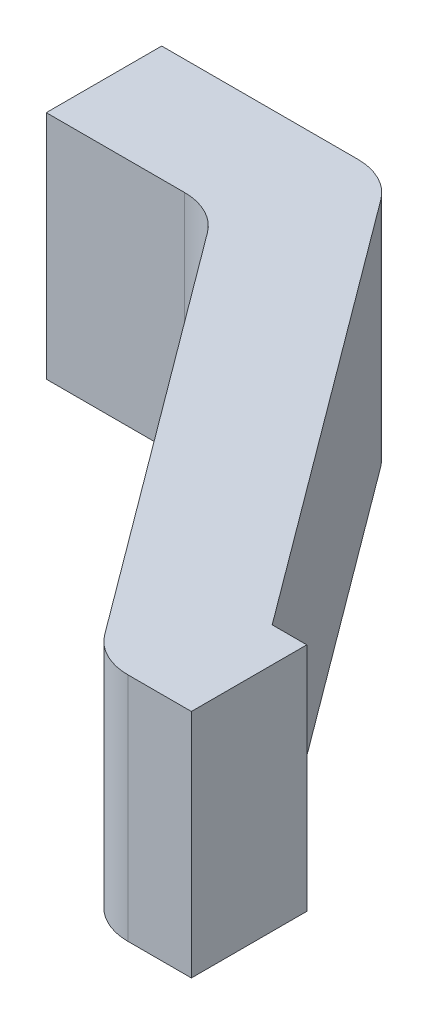
ISO-10303-21;
HEADER;
FILE_DESCRIPTION(('STEP AP214'),'2;1');
FILE_NAME('part.step','',(''),(''),'','','');
FILE_SCHEMA(('AUTOMOTIVE_DESIGN { 1 0 10303 214 1 1 1 1 }'));
ENDSEC;
DATA;
#1=APPLICATION_CONTEXT('core data for automotive mechanical design processes');
#2=APPLICATION_PROTOCOL_DEFINITION('international standard','automotive_design',2000,#1);
#3=PRODUCT_CONTEXT('',#1,'mechanical');
#4=PRODUCT('Part','Part','',(#3));
#5=PRODUCT_RELATED_PRODUCT_CATEGORY('part','',(#4));
#6=PRODUCT_DEFINITION_FORMATION('','',#4);
#7=PRODUCT_DEFINITION_CONTEXT('part definition',#1,'design');
#8=PRODUCT_DEFINITION('design','',#6,#7);
#9=PRODUCT_DEFINITION_SHAPE('','',#8);
#10=(LENGTH_UNIT() NAMED_UNIT(*) SI_UNIT(.MILLI.,.METRE.));
#11=(NAMED_UNIT(*) PLANE_ANGLE_UNIT() SI_UNIT($,.RADIAN.));
#12=(NAMED_UNIT(*) SI_UNIT($,.STERADIAN.) SOLID_ANGLE_UNIT());
#13=UNCERTAINTY_MEASURE_WITH_UNIT(LENGTH_MEASURE(1.E-05),#10,'distance_accuracy_value','');
#14=(GEOMETRIC_REPRESENTATION_CONTEXT(3) GLOBAL_UNCERTAINTY_ASSIGNED_CONTEXT((#13)) GLOBAL_UNIT_ASSIGNED_CONTEXT((#10,
#11,#12)) REPRESENTATION_CONTEXT('',''));
#15=CARTESIAN_POINT('',(0.,0.,0.));
#16=DIRECTION('',(0.,0.,1.));
#17=DIRECTION('',(1.,0.,0.));
#18=AXIS2_PLACEMENT_3D('',#15,#16,#17);
#19=CARTESIAN_POINT('',(-3.,-0.84,0.205));
#20=DIRECTION('',(0.,0.,1.));
#21=DIRECTION('',(1.,0.,0.));
#22=AXIS2_PLACEMENT_3D('',#19,#20,#21);
#23=PLANE('',#22);
#24=DIRECTION('',(1.,0.,0.));
#25=VECTOR('',#24,1.);
#26=CARTESIAN_POINT('',(-3.,-0.43,0.205));
#27=LINE('',#26,#25);
#28=CARTESIAN_POINT('',(-3.,-0.43,0.205));
#29=VERTEX_POINT('',#28);
#30=CARTESIAN_POINT('',(-2.754632601552,-0.43,0.205));
#31=VERTEX_POINT('',#30);
#32=EDGE_CURVE('E11',#29,#31,#27,.T.);
#33=ORIENTED_EDGE('',*,*,#32,.F.);
#34=DIRECTION('',(0.,1.,0.));
#35=VECTOR('',#34,1.);
#36=CARTESIAN_POINT('',(-3.,-0.84,0.205));
#37=LINE('',#36,#35);
#38=CARTESIAN_POINT('',(-3.,-0.84,0.205));
#39=VERTEX_POINT('',#38);
#40=EDGE_CURVE('E24',#39,#29,#37,.T.);
#41=ORIENTED_EDGE('',*,*,#40,.F.);
#42=DIRECTION('',(1.,0.,0.));
#43=VECTOR('',#42,1.);
#44=CARTESIAN_POINT('',(-3.,-0.84,0.205));
#45=LINE('',#44,#43);
#46=CARTESIAN_POINT('',(-2.754632601552,-0.84,0.205));
#47=VERTEX_POINT('',#46);
#48=EDGE_CURVE('E186',#39,#47,#45,.T.);
#49=ORIENTED_EDGE('',*,*,#48,.T.);
#50=DIRECTION('',(0.,1.,0.));
#51=VECTOR('',#50,1.);
#52=CARTESIAN_POINT('',(-2.754632601552,-0.84,0.205));
#53=LINE('',#52,#51);
#54=EDGE_CURVE('E184',#47,#31,#53,.T.);
#55=ORIENTED_EDGE('',*,*,#54,.T.);
#56=EDGE_LOOP('',(#33,#41,#49,#55));
#57=FACE_BOUND('',#56,.T.);
#58=ADVANCED_FACE('F17',(#57),#23,.T.);
#59=CARTESIAN_POINT('',(-3.,-0.43,0.));
#60=DIRECTION('',(0.,1.,0.));
#61=DIRECTION('',(0.,0.,1.));
#62=AXIS2_PLACEMENT_3D('',#59,#60,#61);
#63=PLANE('',#62);
#64=DIRECTION('',(1.,0.,0.));
#65=VECTOR('',#64,1.);
#66=CARTESIAN_POINT('',(-3.,-0.43,0.));
#67=LINE('',#66,#65);
#68=CARTESIAN_POINT('',(-3.,-0.43,0.));
#69=VERTEX_POINT('',#68);
#70=CARTESIAN_POINT('',(-2.651544200517,-0.43,0.));
#71=VERTEX_POINT('',#70);
#72=EDGE_CURVE('E182',#69,#71,#67,.T.);
#73=ORIENTED_EDGE('',*,*,#72,.F.);
#74=DIRECTION('',(0.,0.,1.));
#75=VECTOR('',#74,1.);
#76=CARTESIAN_POINT('',(-3.,-0.43,0.));
#77=LINE('',#76,#75);
#78=EDGE_CURVE('E180',#69,#29,#77,.T.);
#79=ORIENTED_EDGE('',*,*,#78,.T.);
#80=ORIENTED_EDGE('',*,*,#32,.T.);
#81=CARTESIAN_POINT('',(-2.754632601552,-0.43,0.3075));
#82=DIRECTION('',(0.,-1.,0.));
#83=DIRECTION('',(0.,0.,1.));
#84=AXIS2_PLACEMENT_3D('',#81,#82,#83);
#85=CIRCLE('',#84,0.1025);
#86=CARTESIAN_POINT('',(-2.672351357136,-0.43,0.246376789863));
#87=VERTEX_POINT('',#86);
#88=EDGE_CURVE('E178',#31,#87,#85,.T.);
#89=ORIENTED_EDGE('',*,*,#88,.T.);
#90=DIRECTION('',(0.596324001338072,0.,0.802743847954097));
#91=VECTOR('',#90,1.);
#92=CARTESIAN_POINT('',(-2.764562488831,-0.43,0.122246420274));
#93=LINE('',#92,#91);
#94=CARTESIAN_POINT('',(-2.145299532729,-0.43,0.955869630411));
#95=VERTEX_POINT('',#94);
#96=EDGE_CURVE('E176',#87,#95,#93,.T.);
#97=ORIENTED_EDGE('',*,*,#96,.T.);
#98=CARTESIAN_POINT('',(-2.063018288313,-0.43,0.894746420274));
#99=DIRECTION('',(0.,1.,0.));
#100=DIRECTION('',(0.,0.,1.));
#101=AXIS2_PLACEMENT_3D('',#98,#99,#100);
#102=CIRCLE('',#101,0.1025);
#103=CARTESIAN_POINT('',(-2.063018288313,-0.43,0.997246420274));
#104=VERTEX_POINT('',#103);
#105=EDGE_CURVE('E120',#95,#104,#102,.T.);
#106=ORIENTED_EDGE('',*,*,#105,.T.);
#107=DIRECTION('',(1.,0.,0.));
#108=VECTOR('',#107,1.);
#109=CARTESIAN_POINT('',(-2.114562488831,-0.43,0.997246420274));
#110=LINE('',#109,#108);
#111=CARTESIAN_POINT('',(-1.95,-0.43,0.997246420274));
#112=VERTEX_POINT('',#111);
#113=EDGE_CURVE('E173',#104,#112,#110,.T.);
#114=ORIENTED_EDGE('',*,*,#113,.T.);
#115=DIRECTION('',(0.,0.,1.));
#116=VECTOR('',#115,1.);
#117=CARTESIAN_POINT('',(-1.95,-0.43,0.792246420274));
#118=LINE('',#117,#116);
#119=CARTESIAN_POINT('',(-1.95,-0.43,0.792246420274));
#120=VERTEX_POINT('',#119);
#121=EDGE_CURVE('E170',#120,#112,#118,.T.);
#122=ORIENTED_EDGE('',*,*,#121,.F.);
#123=DIRECTION('',(1.,0.,0.));
#124=VECTOR('',#123,1.);
#125=CARTESIAN_POINT('',(-2.114562488831,-0.43,0.792246420274));
#126=LINE('',#125,#124);
#127=CARTESIAN_POINT('',(-2.011474087796,-0.43,0.792246420274));
#128=VERTEX_POINT('',#127);
#129=EDGE_CURVE('E167',#128,#120,#126,.T.);
#130=ORIENTED_EDGE('',*,*,#129,.F.);
#131=DIRECTION('',(0.596324001338072,0.,0.802743847954097));
#132=VECTOR('',#131,1.);
#133=CARTESIAN_POINT('',(-2.6,-0.43,0.));
#134=LINE('',#133,#132);
#135=CARTESIAN_POINT('',(-2.569262956102,-0.43,0.0413767898629));
#136=VERTEX_POINT('',#135);
#137=EDGE_CURVE('E164',#136,#128,#134,.T.);
#138=ORIENTED_EDGE('',*,*,#137,.F.);
#139=CARTESIAN_POINT('',(-2.651544200517,-0.43,0.1025));
#140=DIRECTION('',(0.,-1.,0.));
#141=DIRECTION('',(0.,0.,1.));
#142=AXIS2_PLACEMENT_3D('',#139,#140,#141);
#143=CIRCLE('',#142,0.1025);
#144=EDGE_CURVE('E161',#71,#136,#143,.T.);
#145=ORIENTED_EDGE('',*,*,#144,.F.);
#146=EDGE_LOOP('',(#73,#79,#80,#89,#97,#106,#114,#122,#130,#138,#145));
#147=FACE_BOUND('',#146,.T.);
#148=ADVANCED_FACE('F192',(#147),#63,.T.);
#149=CARTESIAN_POINT('',(-2.754632601552,-0.84,0.3075));
#150=DIRECTION('',(0.,1.,0.));
#151=DIRECTION('',(0.,0.,-1.));
#152=AXIS2_PLACEMENT_3D('',#149,#150,#151);
#153=CYLINDRICAL_SURFACE('',#152,0.1025);
#154=CARTESIAN_POINT('',(-2.754632601552,-0.84,0.3075));
#155=DIRECTION('',(0.,-1.,0.));
#156=DIRECTION('',(0.,0.,1.));
#157=AXIS2_PLACEMENT_3D('',#154,#155,#156);
#158=CIRCLE('',#157,0.1025);
#159=CARTESIAN_POINT('',(-2.672351357136,-0.84,0.246376789863));
#160=VERTEX_POINT('',#159);
#161=EDGE_CURVE('E159',#47,#160,#158,.T.);
#162=ORIENTED_EDGE('',*,*,#161,.T.);
#163=DIRECTION('',(0.,1.,0.));
#164=VECTOR('',#163,1.);
#165=CARTESIAN_POINT('',(-2.672351357136,-0.84,0.246376789863));
#166=LINE('',#165,#164);
#167=EDGE_CURVE('E102',#160,#87,#166,.T.);
#168=ORIENTED_EDGE('',*,*,#167,.T.);
#169=ORIENTED_EDGE('',*,*,#88,.F.);
#170=ORIENTED_EDGE('',*,*,#54,.F.);
#171=EDGE_LOOP('',(#162,#168,#169,#170));
#172=FACE_BOUND('',#171,.T.);
#173=ADVANCED_FACE('F216',(#172),#153,.F.);
#174=CARTESIAN_POINT('',(-3.,-0.84,0.));
#175=DIRECTION('',(1.,0.,0.));
#176=DIRECTION('',(0.,0.,1.));
#177=AXIS2_PLACEMENT_3D('',#174,#175,#176);
#178=PLANE('',#177);
#179=ORIENTED_EDGE('',*,*,#40,.T.);
#180=ORIENTED_EDGE('',*,*,#78,.F.);
#181=DIRECTION('',(0.,1.,0.));
#182=VECTOR('',#181,1.);
#183=CARTESIAN_POINT('',(-3.,-0.84,0.));
#184=LINE('',#183,#182);
#185=CARTESIAN_POINT('',(-3.,-0.84,0.));
#186=VERTEX_POINT('',#185);
#187=EDGE_CURVE('E155',#186,#69,#184,.T.);
#188=ORIENTED_EDGE('',*,*,#187,.F.);
#189=DIRECTION('',(0.,0.,1.));
#190=VECTOR('',#189,1.);
#191=CARTESIAN_POINT('',(-3.,-0.84,0.));
#192=LINE('',#191,#190);
#193=EDGE_CURVE('E152',#186,#39,#192,.T.);
#194=ORIENTED_EDGE('',*,*,#193,.T.);
#195=EDGE_LOOP('',(#179,#180,#188,#194));
#196=FACE_BOUND('',#195,.T.);
#197=ADVANCED_FACE('F189',(#196),#178,.F.);
#198=CARTESIAN_POINT('',(-3.,-0.84,0.));
#199=DIRECTION('',(0.,1.,0.));
#200=DIRECTION('',(0.,0.,1.));
#201=AXIS2_PLACEMENT_3D('',#198,#199,#200);
#202=PLANE('',#201);
#203=CARTESIAN_POINT('',(-2.651544200517,-0.84,0.1025));
#204=DIRECTION('',(0.,-1.,0.));
#205=DIRECTION('',(0.,0.,1.));
#206=AXIS2_PLACEMENT_3D('',#203,#204,#205);
#207=CIRCLE('',#206,0.1025);
#208=CARTESIAN_POINT('',(-2.651544200517,-0.84,0.));
#209=VERTEX_POINT('',#208);
#210=CARTESIAN_POINT('',(-2.569262956102,-0.84,0.0413767898629));
#211=VERTEX_POINT('',#210);
#212=EDGE_CURVE('E150',#209,#211,#207,.T.);
#213=ORIENTED_EDGE('',*,*,#212,.T.);
#214=DIRECTION('',(0.596324001338072,0.,0.802743847954097));
#215=VECTOR('',#214,1.);
#216=CARTESIAN_POINT('',(-2.6,-0.84,0.));
#217=LINE('',#216,#215);
#218=CARTESIAN_POINT('',(-2.011474087796,-0.84,0.792246420274));
#219=VERTEX_POINT('',#218);
#220=EDGE_CURVE('E147',#211,#219,#217,.T.);
#221=ORIENTED_EDGE('',*,*,#220,.T.);
#222=DIRECTION('',(1.,0.,0.));
#223=VECTOR('',#222,1.);
#224=CARTESIAN_POINT('',(-2.114562488831,-0.84,0.792246420274));
#225=LINE('',#224,#223);
#226=CARTESIAN_POINT('',(-1.95,-0.84,0.792246420274));
#227=VERTEX_POINT('',#226);
#228=EDGE_CURVE('E144',#219,#227,#225,.T.);
#229=ORIENTED_EDGE('',*,*,#228,.T.);
#230=DIRECTION('',(0.,0.,1.));
#231=VECTOR('',#230,1.);
#232=CARTESIAN_POINT('',(-1.95,-0.84,0.792246420274));
#233=LINE('',#232,#231);
#234=CARTESIAN_POINT('',(-1.95,-0.84,0.997246420274));
#235=VERTEX_POINT('',#234);
#236=EDGE_CURVE('E142',#227,#235,#233,.T.);
#237=ORIENTED_EDGE('',*,*,#236,.T.);
#238=DIRECTION('',(1.,0.,0.));
#239=VECTOR('',#238,1.);
#240=CARTESIAN_POINT('',(-2.114562488831,-0.84,0.997246420274));
#241=LINE('',#240,#239);
#242=CARTESIAN_POINT('',(-2.063018288313,-0.84,0.997246420274));
#243=VERTEX_POINT('',#242);
#244=EDGE_CURVE('E113',#243,#235,#241,.T.);
#245=ORIENTED_EDGE('',*,*,#244,.F.);
#246=CARTESIAN_POINT('',(-2.063018288313,-0.84,0.894746420274));
#247=DIRECTION('',(0.,1.,0.));
#248=DIRECTION('',(0.,0.,1.));
#249=AXIS2_PLACEMENT_3D('',#246,#247,#248);
#250=CIRCLE('',#249,0.1025);
#251=CARTESIAN_POINT('',(-2.145299532729,-0.84,0.955869630411));
#252=VERTEX_POINT('',#251);
#253=EDGE_CURVE('E106',#252,#243,#250,.T.);
#254=ORIENTED_EDGE('',*,*,#253,.F.);
#255=DIRECTION('',(0.596324001338072,0.,0.802743847954097));
#256=VECTOR('',#255,1.);
#257=CARTESIAN_POINT('',(-2.764562488831,-0.84,0.122246420274));
#258=LINE('',#257,#256);
#259=EDGE_CURVE('E95',#160,#252,#258,.T.);
#260=ORIENTED_EDGE('',*,*,#259,.F.);
#261=ORIENTED_EDGE('',*,*,#161,.F.);
#262=ORIENTED_EDGE('',*,*,#48,.F.);
#263=ORIENTED_EDGE('',*,*,#193,.F.);
#264=DIRECTION('',(1.,0.,0.));
#265=VECTOR('',#264,1.);
#266=CARTESIAN_POINT('',(-3.,-0.84,0.));
#267=LINE('',#266,#265);
#268=EDGE_CURVE('E107',#186,#209,#267,.T.);
#269=ORIENTED_EDGE('',*,*,#268,.T.);
#270=EDGE_LOOP('',(#213,#221,#229,#237,#245,#254,#260,#261,#262,#263,#269));
#271=FACE_BOUND('',#270,.T.);
#272=ADVANCED_FACE('F111',(#271),#202,.F.);
#273=CARTESIAN_POINT('',(-3.,-0.84,0.));
#274=DIRECTION('',(0.,0.,1.));
#275=DIRECTION('',(1.,0.,0.));
#276=AXIS2_PLACEMENT_3D('',#273,#274,#275);
#277=PLANE('',#276);
#278=DIRECTION('',(0.,1.,0.));
#279=VECTOR('',#278,1.);
#280=CARTESIAN_POINT('',(-2.651544200517,-0.84,0.));
#281=LINE('',#280,#279);
#282=EDGE_CURVE('E137',#209,#71,#281,.T.);
#283=ORIENTED_EDGE('',*,*,#282,.F.);
#284=ORIENTED_EDGE('',*,*,#268,.F.);
#285=ORIENTED_EDGE('',*,*,#187,.T.);
#286=ORIENTED_EDGE('',*,*,#72,.T.);
#287=EDGE_LOOP('',(#283,#284,#285,#286));
#288=FACE_BOUND('',#287,.T.);
#289=ADVANCED_FACE('F196',(#288),#277,.F.);
#290=CARTESIAN_POINT('',(-2.651544200517,-0.84,0.1025));
#291=DIRECTION('',(0.,1.,0.));
#292=DIRECTION('',(0.,0.,-1.));
#293=AXIS2_PLACEMENT_3D('',#290,#291,#292);
#294=CYLINDRICAL_SURFACE('',#293,0.1025);
#295=ORIENTED_EDGE('',*,*,#282,.T.);
#296=ORIENTED_EDGE('',*,*,#144,.T.);
#297=DIRECTION('',(0.,1.,0.));
#298=VECTOR('',#297,1.);
#299=CARTESIAN_POINT('',(-2.569262956102,-0.84,0.0413767898629));
#300=LINE('',#299,#298);
#301=EDGE_CURVE('E134',#211,#136,#300,.T.);
#302=ORIENTED_EDGE('',*,*,#301,.F.);
#303=ORIENTED_EDGE('',*,*,#212,.F.);
#304=EDGE_LOOP('',(#295,#296,#302,#303));
#305=FACE_BOUND('',#304,.T.);
#306=ADVANCED_FACE('F201',(#305),#294,.T.);
#307=CARTESIAN_POINT('',(-2.6,-0.84,0.));
#308=DIRECTION('',(0.802743847954097,0.,-0.596324001338072));
#309=DIRECTION('',(0.596324001338072,0.,0.802743847954097));
#310=AXIS2_PLACEMENT_3D('',#307,#308,#309);
#311=PLANE('',#310);
#312=ORIENTED_EDGE('',*,*,#220,.F.);
#313=ORIENTED_EDGE('',*,*,#301,.T.);
#314=ORIENTED_EDGE('',*,*,#137,.T.);
#315=DIRECTION('',(0.,1.,0.));
#316=VECTOR('',#315,1.);
#317=CARTESIAN_POINT('',(-2.011474087796,-0.84,0.792246420274));
#318=LINE('',#317,#316);
#319=EDGE_CURVE('E131',#219,#128,#318,.T.);
#320=ORIENTED_EDGE('',*,*,#319,.F.);
#321=EDGE_LOOP('',(#312,#313,#314,#320));
#322=FACE_BOUND('',#321,.T.);
#323=ADVANCED_FACE('F203',(#322),#311,.T.);
#324=CARTESIAN_POINT('',(-2.114562488831,-0.84,0.792246420274));
#325=DIRECTION('',(0.,0.,1.));
#326=DIRECTION('',(1.,0.,0.));
#327=AXIS2_PLACEMENT_3D('',#324,#325,#326);
#328=PLANE('',#327);
#329=DIRECTION('',(0.,1.,0.));
#330=VECTOR('',#329,1.);
#331=CARTESIAN_POINT('',(-1.95,-0.84,0.792246420274));
#332=LINE('',#331,#330);
#333=EDGE_CURVE('E125',#227,#120,#332,.T.);
#334=ORIENTED_EDGE('',*,*,#333,.F.);
#335=ORIENTED_EDGE('',*,*,#228,.F.);
#336=ORIENTED_EDGE('',*,*,#319,.T.);
#337=ORIENTED_EDGE('',*,*,#129,.T.);
#338=EDGE_LOOP('',(#334,#335,#336,#337));
#339=FACE_BOUND('',#338,.T.);
#340=ADVANCED_FACE('F208',(#339),#328,.F.);
#341=CARTESIAN_POINT('',(-1.95,-0.84,0.792246420274));
#342=DIRECTION('',(1.,0.,0.));
#343=DIRECTION('',(0.,0.,1.));
#344=AXIS2_PLACEMENT_3D('',#341,#342,#343);
#345=PLANE('',#344);
#346=ORIENTED_EDGE('',*,*,#236,.F.);
#347=ORIENTED_EDGE('',*,*,#333,.T.);
#348=ORIENTED_EDGE('',*,*,#121,.T.);
#349=DIRECTION('',(0.,1.,0.));
#350=VECTOR('',#349,1.);
#351=CARTESIAN_POINT('',(-1.95,-0.84,0.997246420274));
#352=LINE('',#351,#350);
#353=EDGE_CURVE('E121',#235,#112,#352,.T.);
#354=ORIENTED_EDGE('',*,*,#353,.F.);
#355=EDGE_LOOP('',(#346,#347,#348,#354));
#356=FACE_BOUND('',#355,.T.);
#357=ADVANCED_FACE('F210',(#356),#345,.T.);
#358=CARTESIAN_POINT('',(-2.764562488831,-0.84,0.122246420274));
#359=DIRECTION('',(0.802743847954097,0.,-0.596324001338072));
#360=DIRECTION('',(0.596324001338072,0.,0.802743847954097));
#361=AXIS2_PLACEMENT_3D('',#358,#359,#360);
#362=PLANE('',#361);
#363=DIRECTION('',(0.,1.,0.));
#364=VECTOR('',#363,1.);
#365=CARTESIAN_POINT('',(-2.145299532729,-0.84,0.955869630411));
#366=LINE('',#365,#364);
#367=EDGE_CURVE('E100',#252,#95,#366,.T.);
#368=ORIENTED_EDGE('',*,*,#367,.T.);
#369=ORIENTED_EDGE('',*,*,#96,.F.);
#370=ORIENTED_EDGE('',*,*,#167,.F.);
#371=ORIENTED_EDGE('',*,*,#259,.T.);
#372=EDGE_LOOP('',(#368,#369,#370,#371));
#373=FACE_BOUND('',#372,.T.);
#374=ADVANCED_FACE('F97',(#373),#362,.F.);
#375=CARTESIAN_POINT('',(-2.114562488831,-0.84,0.997246420274));
#376=DIRECTION('',(0.,0.,1.));
#377=DIRECTION('',(1.,0.,0.));
#378=AXIS2_PLACEMENT_3D('',#375,#376,#377);
#379=PLANE('',#378);
#380=ORIENTED_EDGE('',*,*,#244,.T.);
#381=ORIENTED_EDGE('',*,*,#353,.T.);
#382=ORIENTED_EDGE('',*,*,#113,.F.);
#383=DIRECTION('',(0.,1.,0.));
#384=VECTOR('',#383,1.);
#385=CARTESIAN_POINT('',(-2.063018288313,-0.84,0.997246420274));
#386=LINE('',#385,#384);
#387=EDGE_CURVE('E122',#243,#104,#386,.T.);
#388=ORIENTED_EDGE('',*,*,#387,.F.);
#389=EDGE_LOOP('',(#380,#381,#382,#388));
#390=FACE_BOUND('',#389,.T.);
#391=ADVANCED_FACE('F213',(#390),#379,.T.);
#392=CARTESIAN_POINT('',(-2.063018288313,-0.84,0.894746420274));
#393=DIRECTION('',(0.,1.,0.));
#394=DIRECTION('',(-0.802743847954097,0.,0.596324001338072));
#395=AXIS2_PLACEMENT_3D('',#392,#393,#394);
#396=CYLINDRICAL_SURFACE('',#395,0.1025);
#397=ORIENTED_EDGE('',*,*,#253,.T.);
#398=ORIENTED_EDGE('',*,*,#387,.T.);
#399=ORIENTED_EDGE('',*,*,#105,.F.);
#400=ORIENTED_EDGE('',*,*,#367,.F.);
#401=EDGE_LOOP('',(#397,#398,#399,#400));
#402=FACE_BOUND('',#401,.T.);
#403=ADVANCED_FACE('F119',(#402),#396,.T.);
#404=CLOSED_SHELL('',(#58,#148,#173,#197,#272,#289,#306,#323,#340,#357,#374,#391,#403));
#405=MANIFOLD_SOLID_BREP('B1',#404);
#406=ADVANCED_BREP_SHAPE_REPRESENTATION('',(#18,#405),#14);
#407=SHAPE_DEFINITION_REPRESENTATION(#9,#406);
ENDSEC;
END-ISO-10303-21;
